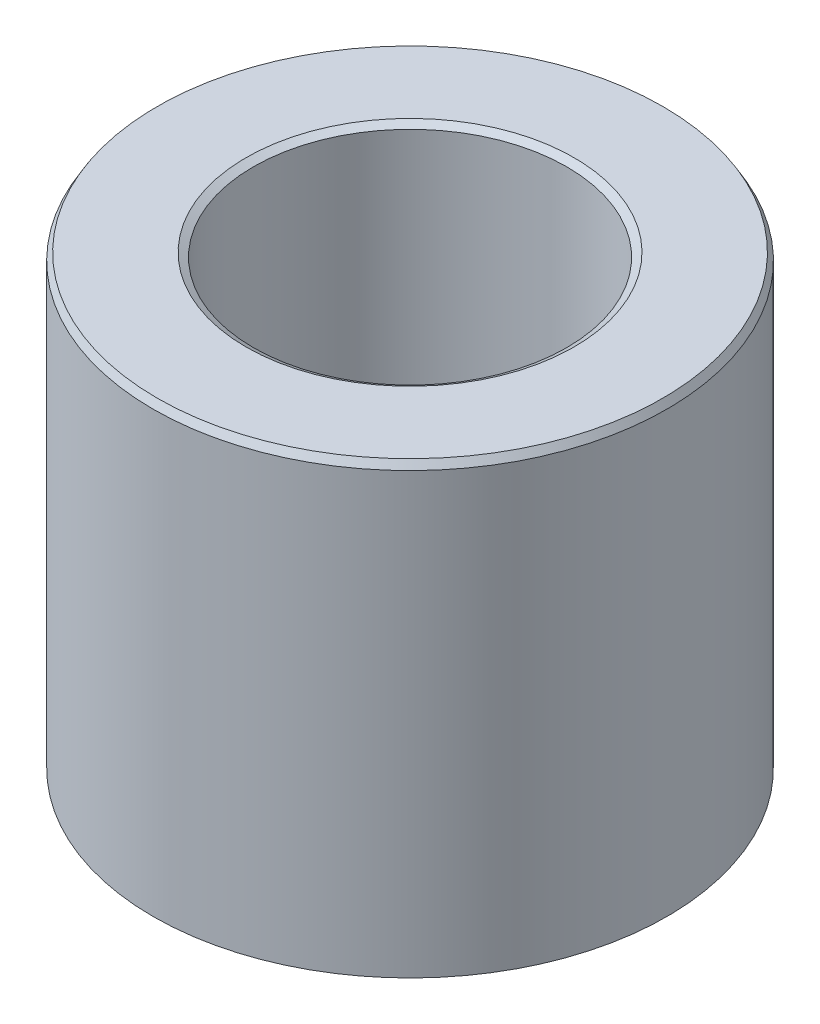
ISO-10303-21;
HEADER;
FILE_DESCRIPTION(('STEP AP214'),'2;1');
FILE_NAME('part.step','',(''),(''),'','','');
FILE_SCHEMA(('AUTOMOTIVE_DESIGN { 1 0 10303 214 1 1 1 1 }'));
ENDSEC;
DATA;
#1=APPLICATION_CONTEXT('core data for automotive mechanical design processes');
#2=APPLICATION_PROTOCOL_DEFINITION('international standard','automotive_design',2000,#1);
#3=PRODUCT_CONTEXT('',#1,'mechanical');
#4=PRODUCT('Part','Part','',(#3));
#5=PRODUCT_RELATED_PRODUCT_CATEGORY('part','',(#4));
#6=PRODUCT_DEFINITION_FORMATION('','',#4);
#7=PRODUCT_DEFINITION_CONTEXT('part definition',#1,'design');
#8=PRODUCT_DEFINITION('design','',#6,#7);
#9=PRODUCT_DEFINITION_SHAPE('','',#8);
#10=(LENGTH_UNIT() NAMED_UNIT(*) SI_UNIT(.MILLI.,.METRE.));
#11=(NAMED_UNIT(*) PLANE_ANGLE_UNIT() SI_UNIT($,.RADIAN.));
#12=(NAMED_UNIT(*) SI_UNIT($,.STERADIAN.) SOLID_ANGLE_UNIT());
#13=UNCERTAINTY_MEASURE_WITH_UNIT(LENGTH_MEASURE(1.E-05),#10,'distance_accuracy_value','');
#14=(GEOMETRIC_REPRESENTATION_CONTEXT(3) GLOBAL_UNCERTAINTY_ASSIGNED_CONTEXT((#13)) GLOBAL_UNIT_ASSIGNED_CONTEXT((#10,
#11,#12)) REPRESENTATION_CONTEXT('',''));
#15=CARTESIAN_POINT('',(0.,0.,0.));
#16=DIRECTION('',(0.,0.,1.));
#17=DIRECTION('',(1.,0.,0.));
#18=AXIS2_PLACEMENT_3D('',#15,#16,#17);
#19=CARTESIAN_POINT('',(0.,100.914058662583,0.));
#20=DIRECTION('',(0.,-1.,0.));
#21=DIRECTION('',(0.,0.,-1.));
#22=AXIS2_PLACEMENT_3D('',#19,#20,#21);
#23=CYLINDRICAL_SURFACE('',#22,57.5);
#24=CARTESIAN_POINT('',(0.,0.947779860217546,0.));
#25=DIRECTION('',(0.,1.,0.));
#26=DIRECTION('',(0.,0.,1.));
#27=AXIS2_PLACEMENT_3D('',#24,#25,#26);
#28=CIRCLE('',#27,57.5);
#29=CARTESIAN_POINT('',(0.,0.947779860217546,57.5));
#30=VERTEX_POINT('',#29);
#31=EDGE_CURVE('E10',#30,#30,#28,.T.);
#32=ORIENTED_EDGE('',*,*,#31,.T.);
#33=EDGE_LOOP('',(#32));
#34=FACE_BOUND('',#33,.T.);
#35=CARTESIAN_POINT('',(0.,99.2724557902955,0.));
#36=DIRECTION('',(0.,1.,0.));
#37=DIRECTION('',(0.,0.,1.));
#38=AXIS2_PLACEMENT_3D('',#35,#36,#37);
#39=CIRCLE('',#38,57.5);
#40=CARTESIAN_POINT('',(0.,99.2724557902955,57.5));
#41=VERTEX_POINT('',#40);
#42=EDGE_CURVE('E50',#41,#41,#39,.F.);
#43=ORIENTED_EDGE('',*,*,#42,.T.);
#44=EDGE_LOOP('',(#43));
#45=FACE_BOUND('',#44,.T.);
#46=ADVANCED_FACE('F39',(#34,#45),#23,.T.);
#47=CARTESIAN_POINT('',(0.,100.914058662583,0.));
#48=DIRECTION('',(0.,1.,0.));
#49=DIRECTION('',(0.,0.,1.));
#50=AXIS2_PLACEMENT_3D('',#47,#48,#49);
#51=PLANE('',#50);
#52=CARTESIAN_POINT('',(0.,100.914058662583,0.));
#53=DIRECTION('',(0.,1.,0.));
#54=DIRECTION('',(0.,0.,1.));
#55=AXIS2_PLACEMENT_3D('',#52,#53,#54);
#56=CIRCLE('',#55,36.7018163755191);
#57=CARTESIAN_POINT('',(0.,100.914058662583,36.7018163755191));
#58=VERTEX_POINT('',#57);
#59=EDGE_CURVE('E58',#58,#58,#56,.F.);
#60=ORIENTED_EDGE('',*,*,#59,.T.);
#61=EDGE_LOOP('',(#60));
#62=FACE_BOUND('',#61,.T.);
#63=CARTESIAN_POINT('',(0.,100.914058662583,0.));
#64=DIRECTION('',(0.,1.,0.));
#65=DIRECTION('',(0.,0.,1.));
#66=AXIS2_PLACEMENT_3D('',#63,#64,#65);
#67=CIRCLE('',#66,56.5522201397825);
#68=CARTESIAN_POINT('',(0.,100.914058662583,56.5522201397825));
#69=VERTEX_POINT('',#68);
#70=EDGE_CURVE('E61',#69,#69,#67,.T.);
#71=ORIENTED_EDGE('',*,*,#70,.T.);
#72=EDGE_LOOP('',(#71));
#73=FACE_BOUND('',#72,.T.);
#74=ADVANCED_FACE('F88',(#62,#73),#51,.T.);
#75=CARTESIAN_POINT('',(0.,0.,0.));
#76=DIRECTION('',(0.,1.,0.));
#77=DIRECTION('',(0.,0.,1.));
#78=AXIS2_PLACEMENT_3D('',#75,#76,#77);
#79=PLANE('',#78);
#80=CARTESIAN_POINT('',(0.,0.,0.));
#81=DIRECTION('',(0.,1.,0.));
#82=DIRECTION('',(0.,0.,1.));
#83=AXIS2_PLACEMENT_3D('',#80,#81,#82);
#84=CIRCLE('',#83,36.0079933634493);
#85=CARTESIAN_POINT('',(0.,0.,36.0079933634493));
#86=VERTEX_POINT('',#85);
#87=EDGE_CURVE('E51',#86,#86,#84,.T.);
#88=ORIENTED_EDGE('',*,*,#87,.T.);
#89=EDGE_LOOP('',(#88));
#90=FACE_BOUND('',#89,.T.);
#91=CARTESIAN_POINT('',(0.,0.,0.));
#92=DIRECTION('',(0.,1.,0.));
#93=DIRECTION('',(0.,0.,1.));
#94=AXIS2_PLACEMENT_3D('',#91,#92,#93);
#95=CIRCLE('',#94,55.8583971277126);
#96=CARTESIAN_POINT('',(0.,0.,55.8583971277126));
#97=VERTEX_POINT('',#96);
#98=EDGE_CURVE('E54',#97,#97,#95,.F.);
#99=ORIENTED_EDGE('',*,*,#98,.T.);
#100=EDGE_LOOP('',(#99));
#101=FACE_BOUND('',#100,.T.);
#102=ADVANCED_FACE('F83',(#90,#101),#79,.F.);
#103=CARTESIAN_POINT('',(0.,100.914058662583,0.));
#104=DIRECTION('',(0.,-1.,0.));
#105=DIRECTION('',(0.,0.,-1.));
#106=AXIS2_PLACEMENT_3D('',#103,#104,#105);
#107=CYLINDRICAL_SURFACE('',#106,35.0602135032317);
#108=CARTESIAN_POINT('',(0.,99.9662788023652,0.));
#109=DIRECTION('',(0.,1.,0.));
#110=DIRECTION('',(0.,0.,1.));
#111=AXIS2_PLACEMENT_3D('',#108,#109,#110);
#112=CIRCLE('',#111,35.0602135032317);
#113=CARTESIAN_POINT('',(0.,99.9662788023652,35.0602135032317));
#114=VERTEX_POINT('',#113);
#115=EDGE_CURVE('E67',#114,#114,#112,.T.);
#116=ORIENTED_EDGE('',*,*,#115,.T.);
#117=EDGE_LOOP('',(#116));
#118=FACE_BOUND('',#117,.T.);
#119=CARTESIAN_POINT('',(0.,1.6416028722874,0.));
#120=DIRECTION('',(0.,1.,0.));
#121=DIRECTION('',(0.,0.,1.));
#122=AXIS2_PLACEMENT_3D('',#119,#120,#121);
#123=CIRCLE('',#122,35.0602135032317);
#124=CARTESIAN_POINT('',(0.,1.6416028722874,35.0602135032317));
#125=VERTEX_POINT('',#124);
#126=EDGE_CURVE('E69',#125,#125,#123,.F.);
#127=ORIENTED_EDGE('',*,*,#126,.T.);
#128=EDGE_LOOP('',(#127));
#129=FACE_BOUND('',#128,.T.);
#130=ADVANCED_FACE('F71',(#118,#129),#107,.F.);
#131=CARTESIAN_POINT('',(0.,99.9662788023652,0.));
#132=DIRECTION('',(0.,1.,0.));
#133=DIRECTION('',(0.,0.,1.));
#134=AXIS2_PLACEMENT_3D('',#131,#132,#133);
#135=CONICAL_SURFACE('',#134,35.0602135032317,1.0471975511966);
#136=ORIENTED_EDGE('',*,*,#59,.F.);
#137=EDGE_LOOP('',(#136));
#138=FACE_BOUND('',#137,.T.);
#139=ORIENTED_EDGE('',*,*,#115,.F.);
#140=EDGE_LOOP('',(#139));
#141=FACE_BOUND('',#140,.T.);
#142=ADVANCED_FACE('F77',(#138,#141),#135,.F.);
#143=CARTESIAN_POINT('',(0.,0.,0.));
#144=DIRECTION('',(0.,-1.,0.));
#145=DIRECTION('',(0.,0.,-1.));
#146=AXIS2_PLACEMENT_3D('',#143,#144,#145);
#147=CONICAL_SURFACE('',#146,36.0079933634493,0.523598775598299);
#148=ORIENTED_EDGE('',*,*,#126,.F.);
#149=EDGE_LOOP('',(#148));
#150=FACE_BOUND('',#149,.T.);
#151=ORIENTED_EDGE('',*,*,#87,.F.);
#152=EDGE_LOOP('',(#151));
#153=FACE_BOUND('',#152,.T.);
#154=ADVANCED_FACE('F73',(#150,#153),#147,.F.);
#155=CARTESIAN_POINT('',(0.,0.947779860217546,0.));
#156=DIRECTION('',(0.,1.,0.));
#157=DIRECTION('',(0.,0.,1.));
#158=AXIS2_PLACEMENT_3D('',#155,#156,#157);
#159=CONICAL_SURFACE('',#158,57.5,1.04719755119661);
#160=ORIENTED_EDGE('',*,*,#98,.F.);
#161=EDGE_LOOP('',(#160));
#162=FACE_BOUND('',#161,.T.);
#163=ORIENTED_EDGE('',*,*,#31,.F.);
#164=EDGE_LOOP('',(#163));
#165=FACE_BOUND('',#164,.T.);
#166=ADVANCED_FACE('F76',(#162,#165),#159,.T.);
#167=CARTESIAN_POINT('',(0.,100.914058662583,0.));
#168=DIRECTION('',(0.,-1.,0.));
#169=DIRECTION('',(0.,0.,-1.));
#170=AXIS2_PLACEMENT_3D('',#167,#168,#169);
#171=CONICAL_SURFACE('',#170,56.5522201397825,0.523598775598288);
#172=ORIENTED_EDGE('',*,*,#42,.F.);
#173=EDGE_LOOP('',(#172));
#174=FACE_BOUND('',#173,.T.);
#175=ORIENTED_EDGE('',*,*,#70,.F.);
#176=EDGE_LOOP('',(#175));
#177=FACE_BOUND('',#176,.T.);
#178=ADVANCED_FACE('F45',(#174,#177),#171,.T.);
#179=CLOSED_SHELL('',(#46,#74,#102,#130,#142,#154,#166,#178));
#180=MANIFOLD_SOLID_BREP('B2',#179);
#181=ADVANCED_BREP_SHAPE_REPRESENTATION('',(#18,#180),#14);
#182=SHAPE_DEFINITION_REPRESENTATION(#9,#181);
ENDSEC;
END-ISO-10303-21;
